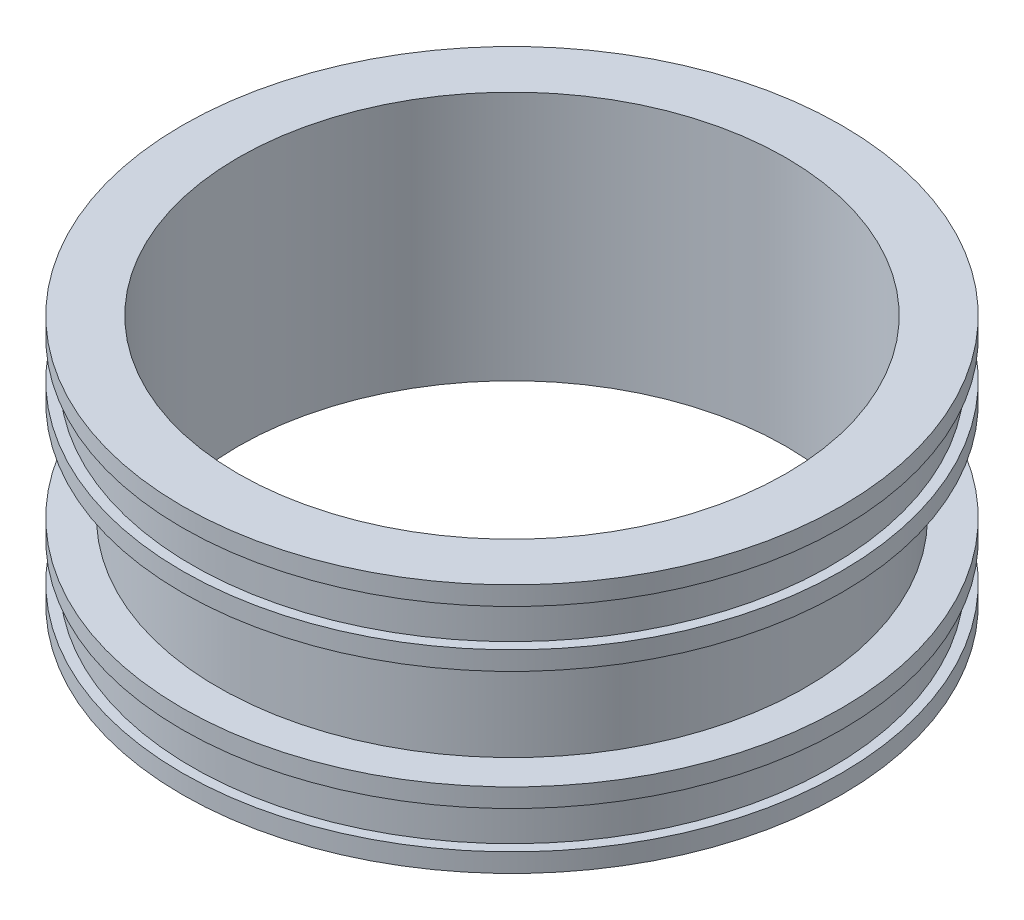
ISO-10303-21;
HEADER;
FILE_DESCRIPTION(('STEP AP214'),'2;1');
FILE_NAME('part.step','',(''),(''),'','','');
FILE_SCHEMA(('AUTOMOTIVE_DESIGN { 1 0 10303 214 1 1 1 1 }'));
ENDSEC;
DATA;
#1=APPLICATION_CONTEXT('core data for automotive mechanical design processes');
#2=APPLICATION_PROTOCOL_DEFINITION('international standard','automotive_design',2000,#1);
#3=PRODUCT_CONTEXT('',#1,'mechanical');
#4=PRODUCT('Part','Part','',(#3));
#5=PRODUCT_RELATED_PRODUCT_CATEGORY('part','',(#4));
#6=PRODUCT_DEFINITION_FORMATION('','',#4);
#7=PRODUCT_DEFINITION_CONTEXT('part definition',#1,'design');
#8=PRODUCT_DEFINITION('design','',#6,#7);
#9=PRODUCT_DEFINITION_SHAPE('','',#8);
#10=(LENGTH_UNIT() NAMED_UNIT(*) SI_UNIT(.MILLI.,.METRE.));
#11=(NAMED_UNIT(*) PLANE_ANGLE_UNIT() SI_UNIT($,.RADIAN.));
#12=(NAMED_UNIT(*) SI_UNIT($,.STERADIAN.) SOLID_ANGLE_UNIT());
#13=UNCERTAINTY_MEASURE_WITH_UNIT(LENGTH_MEASURE(1.E-05),#10,'distance_accuracy_value','');
#14=(GEOMETRIC_REPRESENTATION_CONTEXT(3) GLOBAL_UNCERTAINTY_ASSIGNED_CONTEXT((#13)) GLOBAL_UNIT_ASSIGNED_CONTEXT((#10,
#11,#12)) REPRESENTATION_CONTEXT('',''));
#15=CARTESIAN_POINT('',(0.,0.,0.));
#16=DIRECTION('',(0.,0.,1.));
#17=DIRECTION('',(1.,0.,0.));
#18=AXIS2_PLACEMENT_3D('',#15,#16,#17);
#19=CARTESIAN_POINT('',(0.,0.,0.));
#20=DIRECTION('',(0.,-1.,0.));
#21=DIRECTION('',(0.,0.,-1.));
#22=AXIS2_PLACEMENT_3D('',#19,#20,#21);
#23=CYLINDRICAL_SURFACE('',#22,109.54);
#24=CARTESIAN_POINT('',(0.,0.,0.));
#25=DIRECTION('',(0.,-1.,0.));
#26=DIRECTION('',(0.,0.,-1.));
#27=AXIS2_PLACEMENT_3D('',#24,#25,#26);
#28=CIRCLE('',#27,109.54);
#29=CARTESIAN_POINT('',(0.,0.,-109.54));
#30=VERTEX_POINT('',#29);
#31=EDGE_CURVE('E92',#30,#30,#28,.T.);
#32=ORIENTED_EDGE('',*,*,#31,.T.);
#33=EDGE_LOOP('',(#32));
#34=FACE_BOUND('',#33,.T.);
#35=CARTESIAN_POINT('',(0.,100.,0.));
#36=DIRECTION('',(0.,-1.,0.));
#37=DIRECTION('',(0.,0.,-1.));
#38=AXIS2_PLACEMENT_3D('',#35,#36,#37);
#39=CIRCLE('',#38,109.54);
#40=CARTESIAN_POINT('',(0.,100.,-109.54));
#41=VERTEX_POINT('',#40);
#42=EDGE_CURVE('E12',#41,#41,#39,.T.);
#43=ORIENTED_EDGE('',*,*,#42,.F.);
#44=EDGE_LOOP('',(#43));
#45=FACE_BOUND('',#44,.T.);
#46=ADVANCED_FACE('F40',(#34,#45),#23,.F.);
#47=CARTESIAN_POINT('',(109.54,100.,0.));
#48=DIRECTION('',(0.,1.,0.));
#49=DIRECTION('',(0.,0.,1.));
#50=AXIS2_PLACEMENT_3D('',#47,#48,#49);
#51=PLANE('',#50);
#52=ORIENTED_EDGE('',*,*,#42,.T.);
#53=EDGE_LOOP('',(#52));
#54=FACE_BOUND('',#53,.T.);
#55=CARTESIAN_POINT('',(0.,100.,0.));
#56=DIRECTION('',(0.,-1.,0.));
#57=DIRECTION('',(0.,0.,-1.));
#58=AXIS2_PLACEMENT_3D('',#55,#56,#57);
#59=CIRCLE('',#58,131.9);
#60=CARTESIAN_POINT('',(0.,100.,-131.9));
#61=VERTEX_POINT('',#60);
#62=EDGE_CURVE('E46',#61,#61,#59,.T.);
#63=ORIENTED_EDGE('',*,*,#62,.F.);
#64=EDGE_LOOP('',(#63));
#65=FACE_BOUND('',#64,.T.);
#66=ADVANCED_FACE('F110',(#54,#65),#51,.T.);
#67=CARTESIAN_POINT('',(0.,0.,0.));
#68=DIRECTION('',(0.,-1.,0.));
#69=DIRECTION('',(0.,0.,-1.));
#70=AXIS2_PLACEMENT_3D('',#67,#68,#69);
#71=CYLINDRICAL_SURFACE('',#70,131.9);
#72=ORIENTED_EDGE('',*,*,#62,.T.);
#73=EDGE_LOOP('',(#72));
#74=FACE_BOUND('',#73,.T.);
#75=CARTESIAN_POINT('',(0.,92.5,0.));
#76=DIRECTION('',(0.,-1.,0.));
#77=DIRECTION('',(0.,0.,-1.));
#78=AXIS2_PLACEMENT_3D('',#75,#76,#77);
#79=CIRCLE('',#78,131.9);
#80=CARTESIAN_POINT('',(0.,92.5,-131.9));
#81=VERTEX_POINT('',#80);
#82=EDGE_CURVE('E50',#81,#81,#79,.T.);
#83=ORIENTED_EDGE('',*,*,#82,.F.);
#84=EDGE_LOOP('',(#83));
#85=FACE_BOUND('',#84,.T.);
#86=ADVANCED_FACE('F114',(#74,#85),#71,.T.);
#87=CARTESIAN_POINT('',(131.9,92.5,0.));
#88=DIRECTION('',(0.,-1.,0.));
#89=DIRECTION('',(0.,0.,-1.));
#90=AXIS2_PLACEMENT_3D('',#87,#88,#89);
#91=PLANE('',#90);
#92=ORIENTED_EDGE('',*,*,#82,.T.);
#93=EDGE_LOOP('',(#92));
#94=FACE_BOUND('',#93,.T.);
#95=CARTESIAN_POINT('',(0.,92.5,0.));
#96=DIRECTION('',(0.,-1.,0.));
#97=DIRECTION('',(0.,0.,-1.));
#98=AXIS2_PLACEMENT_3D('',#95,#96,#97);
#99=CIRCLE('',#98,127.9);
#100=CARTESIAN_POINT('',(0.,92.5,-127.9));
#101=VERTEX_POINT('',#100);
#102=EDGE_CURVE('E54',#101,#101,#99,.T.);
#103=ORIENTED_EDGE('',*,*,#102,.F.);
#104=EDGE_LOOP('',(#103));
#105=FACE_BOUND('',#104,.T.);
#106=ADVANCED_FACE('F118',(#94,#105),#91,.T.);
#107=CARTESIAN_POINT('',(0.,0.,0.));
#108=DIRECTION('',(0.,-1.,0.));
#109=DIRECTION('',(0.,0.,-1.));
#110=AXIS2_PLACEMENT_3D('',#107,#108,#109);
#111=CYLINDRICAL_SURFACE('',#110,127.9);
#112=ORIENTED_EDGE('',*,*,#102,.T.);
#113=EDGE_LOOP('',(#112));
#114=FACE_BOUND('',#113,.T.);
#115=CARTESIAN_POINT('',(0.,77.4999999999999,0.));
#116=DIRECTION('',(0.,-1.,0.));
#117=DIRECTION('',(0.,0.,-1.));
#118=AXIS2_PLACEMENT_3D('',#115,#116,#117);
#119=CIRCLE('',#118,127.9);
#120=CARTESIAN_POINT('',(0.,77.4999999999999,-127.9));
#121=VERTEX_POINT('',#120);
#122=EDGE_CURVE('E59',#121,#121,#119,.T.);
#123=ORIENTED_EDGE('',*,*,#122,.F.);
#124=EDGE_LOOP('',(#123));
#125=FACE_BOUND('',#124,.T.);
#126=ADVANCED_FACE('F124',(#114,#125),#111,.T.);
#127=CARTESIAN_POINT('',(127.9,77.4999999999999,0.));
#128=DIRECTION('',(0.,1.,0.));
#129=DIRECTION('',(0.,0.,1.));
#130=AXIS2_PLACEMENT_3D('',#127,#128,#129);
#131=PLANE('',#130);
#132=ORIENTED_EDGE('',*,*,#122,.T.);
#133=EDGE_LOOP('',(#132));
#134=FACE_BOUND('',#133,.T.);
#135=CARTESIAN_POINT('',(0.,77.4999999999999,0.));
#136=DIRECTION('',(0.,-1.,0.));
#137=DIRECTION('',(0.,0.,-1.));
#138=AXIS2_PLACEMENT_3D('',#135,#136,#137);
#139=CIRCLE('',#138,131.9);
#140=CARTESIAN_POINT('',(0.,77.4999999999999,-131.9));
#141=VERTEX_POINT('',#140);
#142=EDGE_CURVE('E62',#141,#141,#139,.T.);
#143=ORIENTED_EDGE('',*,*,#142,.F.);
#144=EDGE_LOOP('',(#143));
#145=FACE_BOUND('',#144,.T.);
#146=ADVANCED_FACE('F128',(#134,#145),#131,.T.);
#147=CARTESIAN_POINT('',(0.,0.,0.));
#148=DIRECTION('',(0.,-1.,0.));
#149=DIRECTION('',(0.,0.,-1.));
#150=AXIS2_PLACEMENT_3D('',#147,#148,#149);
#151=CYLINDRICAL_SURFACE('',#150,131.9);
#152=ORIENTED_EDGE('',*,*,#142,.T.);
#153=EDGE_LOOP('',(#152));
#154=FACE_BOUND('',#153,.T.);
#155=CARTESIAN_POINT('',(0.,70.0000000000001,0.));
#156=DIRECTION('',(0.,-1.,0.));
#157=DIRECTION('',(0.,0.,-1.));
#158=AXIS2_PLACEMENT_3D('',#155,#156,#157);
#159=CIRCLE('',#158,131.9);
#160=CARTESIAN_POINT('',(0.,70.0000000000001,-131.9));
#161=VERTEX_POINT('',#160);
#162=EDGE_CURVE('E65',#161,#161,#159,.T.);
#163=ORIENTED_EDGE('',*,*,#162,.F.);
#164=EDGE_LOOP('',(#163));
#165=FACE_BOUND('',#164,.T.);
#166=ADVANCED_FACE('F132',(#154,#165),#151,.T.);
#167=CARTESIAN_POINT('',(131.9,70.0000000000001,0.));
#168=DIRECTION('',(0.,-1.,0.));
#169=DIRECTION('',(0.,0.,-1.));
#170=AXIS2_PLACEMENT_3D('',#167,#168,#169);
#171=PLANE('',#170);
#172=ORIENTED_EDGE('',*,*,#162,.T.);
#173=EDGE_LOOP('',(#172));
#174=FACE_BOUND('',#173,.T.);
#175=CARTESIAN_POINT('',(0.,70.0000000000001,0.));
#176=DIRECTION('',(0.,-1.,0.));
#177=DIRECTION('',(0.,0.,-1.));
#178=AXIS2_PLACEMENT_3D('',#175,#176,#177);
#179=CIRCLE('',#178,117.54);
#180=CARTESIAN_POINT('',(0.,70.0000000000001,-117.54));
#181=VERTEX_POINT('',#180);
#182=EDGE_CURVE('E68',#181,#181,#179,.T.);
#183=ORIENTED_EDGE('',*,*,#182,.F.);
#184=EDGE_LOOP('',(#183));
#185=FACE_BOUND('',#184,.T.);
#186=ADVANCED_FACE('F136',(#174,#185),#171,.T.);
#187=CARTESIAN_POINT('',(0.,0.,0.));
#188=DIRECTION('',(0.,-1.,0.));
#189=DIRECTION('',(0.,0.,-1.));
#190=AXIS2_PLACEMENT_3D('',#187,#188,#189);
#191=CYLINDRICAL_SURFACE('',#190,117.54);
#192=ORIENTED_EDGE('',*,*,#182,.T.);
#193=EDGE_LOOP('',(#192));
#194=FACE_BOUND('',#193,.T.);
#195=CARTESIAN_POINT('',(0.,30.,0.));
#196=DIRECTION('',(0.,-1.,0.));
#197=DIRECTION('',(0.,0.,-1.));
#198=AXIS2_PLACEMENT_3D('',#195,#196,#197);
#199=CIRCLE('',#198,117.54);
#200=CARTESIAN_POINT('',(0.,30.,-117.54));
#201=VERTEX_POINT('',#200);
#202=EDGE_CURVE('E71',#201,#201,#199,.T.);
#203=ORIENTED_EDGE('',*,*,#202,.F.);
#204=EDGE_LOOP('',(#203));
#205=FACE_BOUND('',#204,.T.);
#206=ADVANCED_FACE('F140',(#194,#205),#191,.T.);
#207=CARTESIAN_POINT('',(117.54,30.,0.));
#208=DIRECTION('',(0.,1.,0.));
#209=DIRECTION('',(0.,0.,1.));
#210=AXIS2_PLACEMENT_3D('',#207,#208,#209);
#211=PLANE('',#210);
#212=ORIENTED_EDGE('',*,*,#202,.T.);
#213=EDGE_LOOP('',(#212));
#214=FACE_BOUND('',#213,.T.);
#215=CARTESIAN_POINT('',(0.,30.,0.));
#216=DIRECTION('',(0.,-1.,0.));
#217=DIRECTION('',(0.,0.,-1.));
#218=AXIS2_PLACEMENT_3D('',#215,#216,#217);
#219=CIRCLE('',#218,131.9);
#220=CARTESIAN_POINT('',(0.,30.,-131.9));
#221=VERTEX_POINT('',#220);
#222=EDGE_CURVE('E74',#221,#221,#219,.T.);
#223=ORIENTED_EDGE('',*,*,#222,.F.);
#224=EDGE_LOOP('',(#223));
#225=FACE_BOUND('',#224,.T.);
#226=ADVANCED_FACE('F144',(#214,#225),#211,.T.);
#227=CARTESIAN_POINT('',(0.,0.,0.));
#228=DIRECTION('',(0.,-1.,0.));
#229=DIRECTION('',(0.,0.,-1.));
#230=AXIS2_PLACEMENT_3D('',#227,#228,#229);
#231=CYLINDRICAL_SURFACE('',#230,131.9);
#232=ORIENTED_EDGE('',*,*,#222,.T.);
#233=EDGE_LOOP('',(#232));
#234=FACE_BOUND('',#233,.T.);
#235=CARTESIAN_POINT('',(0.,22.5,0.));
#236=DIRECTION('',(0.,-1.,0.));
#237=DIRECTION('',(0.,0.,-1.));
#238=AXIS2_PLACEMENT_3D('',#235,#236,#237);
#239=CIRCLE('',#238,131.9);
#240=CARTESIAN_POINT('',(0.,22.5,-131.9));
#241=VERTEX_POINT('',#240);
#242=EDGE_CURVE('E77',#241,#241,#239,.T.);
#243=ORIENTED_EDGE('',*,*,#242,.F.);
#244=EDGE_LOOP('',(#243));
#245=FACE_BOUND('',#244,.T.);
#246=ADVANCED_FACE('F148',(#234,#245),#231,.T.);
#247=CARTESIAN_POINT('',(127.9,22.5,0.));
#248=DIRECTION('',(0.,-1.,0.));
#249=DIRECTION('',(0.,0.,-1.));
#250=AXIS2_PLACEMENT_3D('',#247,#248,#249);
#251=PLANE('',#250);
#252=ORIENTED_EDGE('',*,*,#242,.T.);
#253=EDGE_LOOP('',(#252));
#254=FACE_BOUND('',#253,.T.);
#255=CARTESIAN_POINT('',(0.,22.5,0.));
#256=DIRECTION('',(0.,-1.,0.));
#257=DIRECTION('',(0.,0.,-1.));
#258=AXIS2_PLACEMENT_3D('',#255,#256,#257);
#259=CIRCLE('',#258,127.9);
#260=CARTESIAN_POINT('',(0.,22.5,-127.9));
#261=VERTEX_POINT('',#260);
#262=EDGE_CURVE('E80',#261,#261,#259,.T.);
#263=ORIENTED_EDGE('',*,*,#262,.F.);
#264=EDGE_LOOP('',(#263));
#265=FACE_BOUND('',#264,.T.);
#266=ADVANCED_FACE('F152',(#254,#265),#251,.T.);
#267=CARTESIAN_POINT('',(0.,0.,0.));
#268=DIRECTION('',(0.,-1.,0.));
#269=DIRECTION('',(0.,0.,-1.));
#270=AXIS2_PLACEMENT_3D('',#267,#268,#269);
#271=CYLINDRICAL_SURFACE('',#270,127.9);
#272=ORIENTED_EDGE('',*,*,#262,.T.);
#273=EDGE_LOOP('',(#272));
#274=FACE_BOUND('',#273,.T.);
#275=CARTESIAN_POINT('',(0.,7.50000000000006,0.));
#276=DIRECTION('',(0.,-1.,0.));
#277=DIRECTION('',(0.,0.,-1.));
#278=AXIS2_PLACEMENT_3D('',#275,#276,#277);
#279=CIRCLE('',#278,127.9);
#280=CARTESIAN_POINT('',(0.,7.50000000000006,-127.9));
#281=VERTEX_POINT('',#280);
#282=EDGE_CURVE('E83',#281,#281,#279,.T.);
#283=ORIENTED_EDGE('',*,*,#282,.F.);
#284=EDGE_LOOP('',(#283));
#285=FACE_BOUND('',#284,.T.);
#286=ADVANCED_FACE('F156',(#274,#285),#271,.T.);
#287=CARTESIAN_POINT('',(131.9,7.50000000000006,0.));
#288=DIRECTION('',(0.,1.,0.));
#289=DIRECTION('',(0.,0.,1.));
#290=AXIS2_PLACEMENT_3D('',#287,#288,#289);
#291=PLANE('',#290);
#292=ORIENTED_EDGE('',*,*,#282,.T.);
#293=EDGE_LOOP('',(#292));
#294=FACE_BOUND('',#293,.T.);
#295=CARTESIAN_POINT('',(0.,7.50000000000006,0.));
#296=DIRECTION('',(0.,-1.,0.));
#297=DIRECTION('',(0.,0.,-1.));
#298=AXIS2_PLACEMENT_3D('',#295,#296,#297);
#299=CIRCLE('',#298,131.9);
#300=CARTESIAN_POINT('',(0.,7.50000000000006,-131.9));
#301=VERTEX_POINT('',#300);
#302=EDGE_CURVE('E86',#301,#301,#299,.T.);
#303=ORIENTED_EDGE('',*,*,#302,.F.);
#304=EDGE_LOOP('',(#303));
#305=FACE_BOUND('',#304,.T.);
#306=ADVANCED_FACE('F106',(#294,#305),#291,.T.);
#307=CARTESIAN_POINT('',(0.,0.,0.));
#308=DIRECTION('',(0.,-1.,0.));
#309=DIRECTION('',(0.,0.,-1.));
#310=AXIS2_PLACEMENT_3D('',#307,#308,#309);
#311=CYLINDRICAL_SURFACE('',#310,131.9);
#312=ORIENTED_EDGE('',*,*,#302,.T.);
#313=EDGE_LOOP('',(#312));
#314=FACE_BOUND('',#313,.T.);
#315=CARTESIAN_POINT('',(0.,0.,0.));
#316=DIRECTION('',(0.,-1.,0.));
#317=DIRECTION('',(0.,0.,-1.));
#318=AXIS2_PLACEMENT_3D('',#315,#316,#317);
#319=CIRCLE('',#318,131.9);
#320=CARTESIAN_POINT('',(0.,0.,-131.9));
#321=VERTEX_POINT('',#320);
#322=EDGE_CURVE('E89',#321,#321,#319,.T.);
#323=ORIENTED_EDGE('',*,*,#322,.F.);
#324=EDGE_LOOP('',(#323));
#325=FACE_BOUND('',#324,.T.);
#326=ADVANCED_FACE('F100',(#314,#325),#311,.T.);
#327=CARTESIAN_POINT('',(131.9,0.,0.));
#328=DIRECTION('',(0.,-1.,0.));
#329=DIRECTION('',(0.,0.,-1.));
#330=AXIS2_PLACEMENT_3D('',#327,#328,#329);
#331=PLANE('',#330);
#332=ORIENTED_EDGE('',*,*,#322,.T.);
#333=EDGE_LOOP('',(#332));
#334=FACE_BOUND('',#333,.T.);
#335=ORIENTED_EDGE('',*,*,#31,.F.);
#336=EDGE_LOOP('',(#335));
#337=FACE_BOUND('',#336,.T.);
#338=ADVANCED_FACE('F98',(#334,#337),#331,.T.);
#339=CLOSED_SHELL('',(#46,#66,#86,#106,#126,#146,#166,#186,#206,#226,#246,#266,#286,#306,#326,#338));
#340=MANIFOLD_SOLID_BREP('B2',#339);
#341=ADVANCED_BREP_SHAPE_REPRESENTATION('',(#18,#340),#14);
#342=SHAPE_DEFINITION_REPRESENTATION(#9,#341);
ENDSEC;
END-ISO-10303-21;
